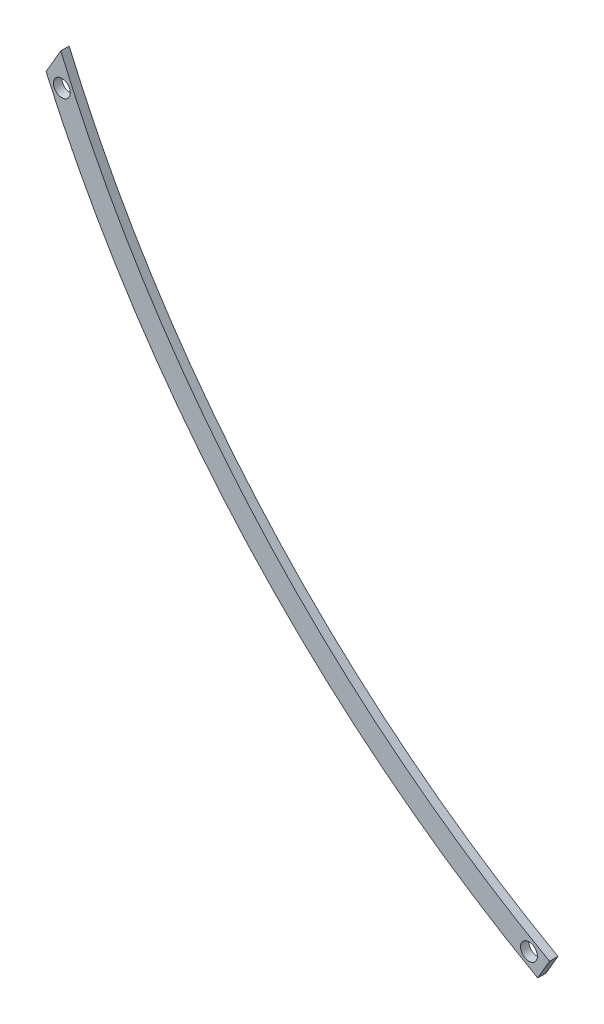
ISO-10303-21;
HEADER;
FILE_DESCRIPTION(('STEP AP214'),'2;1');
FILE_NAME('part.step','',(''),(''),'','','');
FILE_SCHEMA(('AUTOMOTIVE_DESIGN { 1 0 10303 214 1 1 1 1 }'));
ENDSEC;
DATA;
#1=APPLICATION_CONTEXT('core data for automotive mechanical design processes');
#2=APPLICATION_PROTOCOL_DEFINITION('international standard','automotive_design',2000,#1);
#3=PRODUCT_CONTEXT('',#1,'mechanical');
#4=PRODUCT('Part','Part','',(#3));
#5=PRODUCT_RELATED_PRODUCT_CATEGORY('part','',(#4));
#6=PRODUCT_DEFINITION_FORMATION('','',#4);
#7=PRODUCT_DEFINITION_CONTEXT('part definition',#1,'design');
#8=PRODUCT_DEFINITION('design','',#6,#7);
#9=PRODUCT_DEFINITION_SHAPE('','',#8);
#10=(LENGTH_UNIT() NAMED_UNIT(*) SI_UNIT(.MILLI.,.METRE.));
#11=(NAMED_UNIT(*) PLANE_ANGLE_UNIT() SI_UNIT($,.RADIAN.));
#12=(NAMED_UNIT(*) SI_UNIT($,.STERADIAN.) SOLID_ANGLE_UNIT());
#13=UNCERTAINTY_MEASURE_WITH_UNIT(LENGTH_MEASURE(1.E-05),#10,'distance_accuracy_value','');
#14=(GEOMETRIC_REPRESENTATION_CONTEXT(3) GLOBAL_UNCERTAINTY_ASSIGNED_CONTEXT((#13)) GLOBAL_UNIT_ASSIGNED_CONTEXT((#10,
#11,#12)) REPRESENTATION_CONTEXT('',''));
#15=CARTESIAN_POINT('',(0.,0.,0.));
#16=DIRECTION('',(0.,0.,1.));
#17=DIRECTION('',(1.,0.,0.));
#18=AXIS2_PLACEMENT_3D('',#15,#16,#17);
#19=CARTESIAN_POINT('',(3412.34924773845,5885.24743515971,50.));
#20=DIRECTION('',(0.,0.,-1.));
#21=DIRECTION('',(-1.,0.,0.));
#22=AXIS2_PLACEMENT_3D('',#19,#20,#21);
#23=PLANE('',#22);
#24=CARTESIAN_POINT('',(3412.34924773845,5885.24743515971,50.));
#25=DIRECTION('',(0.,0.,-1.));
#26=DIRECTION('',(-1.,0.,0.));
#27=AXIS2_PLACEMENT_3D('',#24,#25,#26);
#28=CIRCLE('',#27,6732.95999999964);
#29=CARTESIAN_POINT('',(121.994454448105,11.0397697918607,50.));
#30=VERTEX_POINT('',#29);
#31=CARTESIAN_POINT('',(-2779.46844110716,3240.60302244677,50.));
#32=VERTEX_POINT('',#31);
#33=EDGE_CURVE('E50',#30,#32,#28,.T.);
#34=ORIENTED_EDGE('',*,*,#33,.T.);
#35=DIRECTION('',(-0.501597723305544,-0.865100990621728,0.));
#36=VECTOR('',#35,1.);
#37=CARTESIAN_POINT('',(-2779.46844110716,3240.60302244677,50.));
#38=LINE('',#37,#36);
#39=CARTESIAN_POINT('',(-2866.63608223872,3090.26579165529,50.));
#40=VERTEX_POINT('',#39);
#41=EDGE_CURVE('E79',#32,#40,#38,.T.);
#42=ORIENTED_EDGE('',*,*,#41,.T.);
#43=CARTESIAN_POINT('',(3412.34924773845,5885.24743515971,50.));
#44=DIRECTION('',(0.,0.,1.));
#45=DIRECTION('',(-1.,0.,0.));
#46=AXIS2_PLACEMENT_3D('',#43,#44,#45);
#47=CIRCLE('',#46,6872.95999999965);
#48=CARTESIAN_POINT('',(51.7631843671055,-110.087457260338,50.));
#49=VERTEX_POINT('',#48);
#50=EDGE_CURVE('E83',#40,#49,#47,.T.);
#51=ORIENTED_EDGE('',*,*,#50,.T.);
#52=DIRECTION('',(0.501597723305545,0.865100990621728,0.));
#53=VECTOR('',#52,1.);
#54=CARTESIAN_POINT('',(51.7631843671055,-110.087457260338,50.));
#55=LINE('',#54,#53);
#56=EDGE_CURVE('E92',#49,#30,#55,.T.);
#57=ORIENTED_EDGE('',*,*,#56,.T.);
#58=EDGE_LOOP('',(#34,#42,#51,#57));
#59=FACE_BOUND('',#58,.T.);
#60=CARTESIAN_POINT('',(-2772.84973901146,3052.65529086794,50.));
#61=DIRECTION('',(0.,0.,1.));
#62=DIRECTION('',(1.,0.,0.));
#63=AXIS2_PLACEMENT_3D('',#60,#61,#62);
#64=CIRCLE('',#63,50.);
#65=CARTESIAN_POINT('',(-2722.84973901146,3052.65529086794,50.));
#66=VERTEX_POINT('',#65);
#67=EDGE_CURVE('E99',#66,#66,#64,.T.);
#68=ORIENTED_EDGE('',*,*,#67,.F.);
#69=EDGE_LOOP('',(#68));
#70=FACE_BOUND('',#69,.T.);
#71=CARTESIAN_POINT('',(0.,0.,50.));
#72=DIRECTION('',(0.,0.,1.));
#73=DIRECTION('',(1.,0.,0.));
#74=AXIS2_PLACEMENT_3D('',#71,#72,#73);
#75=CIRCLE('',#74,50.0000000000012);
#76=CARTESIAN_POINT('',(50.0000000000012,0.,50.));
#77=VERTEX_POINT('',#76);
#78=EDGE_CURVE('E137',#77,#77,#75,.T.);
#79=ORIENTED_EDGE('',*,*,#78,.F.);
#80=EDGE_LOOP('',(#79));
#81=FACE_BOUND('',#80,.T.);
#82=ADVANCED_FACE('F33',(#59,#70,#81),#23,.F.);
#83=CARTESIAN_POINT('',(3412.34924773845,5885.24743515971,0.));
#84=DIRECTION('',(0.,0.,-1.));
#85=DIRECTION('',(-1.,0.,0.));
#86=AXIS2_PLACEMENT_3D('',#83,#84,#85);
#87=PLANE('',#86);
#88=CARTESIAN_POINT('',(-2772.84973901146,3052.65529086794,0.));
#89=DIRECTION('',(0.,0.,1.));
#90=DIRECTION('',(1.,0.,0.));
#91=AXIS2_PLACEMENT_3D('',#88,#89,#90);
#92=CIRCLE('',#91,50.);
#93=CARTESIAN_POINT('',(-2722.84973901146,3052.65529086794,0.));
#94=VERTEX_POINT('',#93);
#95=EDGE_CURVE('E142',#94,#94,#92,.T.);
#96=ORIENTED_EDGE('',*,*,#95,.T.);
#97=EDGE_LOOP('',(#96));
#98=FACE_BOUND('',#97,.T.);
#99=DIRECTION('',(-0.501597723305544,-0.865100990621728,0.));
#100=VECTOR('',#99,1.);
#101=CARTESIAN_POINT('',(-2779.46844110716,3240.60302244677,0.));
#102=LINE('',#101,#100);
#103=CARTESIAN_POINT('',(-2779.46844110716,3240.60302244677,0.));
#104=VERTEX_POINT('',#103);
#105=CARTESIAN_POINT('',(-2866.63608223872,3090.26579165529,0.));
#106=VERTEX_POINT('',#105);
#107=EDGE_CURVE('E88',#104,#106,#102,.T.);
#108=ORIENTED_EDGE('',*,*,#107,.F.);
#109=CARTESIAN_POINT('',(3412.34924773851,5885.24743515972,0.));
#110=DIRECTION('',(0.,0.,-1.));
#111=DIRECTION('',(1.,0.,0.));
#112=AXIS2_PLACEMENT_3D('',#109,#110,#111);
#113=CIRCLE('',#112,6732.95999999968);
#114=CARTESIAN_POINT('',(121.994454448105,11.0397697918607,0.));
#115=VERTEX_POINT('',#114);
#116=EDGE_CURVE('E102',#115,#104,#113,.T.);
#117=ORIENTED_EDGE('',*,*,#116,.F.);
#118=DIRECTION('',(0.501597723305545,0.865100990621728,0.));
#119=VECTOR('',#118,1.);
#120=CARTESIAN_POINT('',(51.7631843671055,-110.087457260338,0.));
#121=LINE('',#120,#119);
#122=CARTESIAN_POINT('',(51.7631843671055,-110.087457260338,0.));
#123=VERTEX_POINT('',#122);
#124=EDGE_CURVE('E74',#123,#115,#121,.T.);
#125=ORIENTED_EDGE('',*,*,#124,.F.);
#126=CARTESIAN_POINT('',(3412.34924773851,5885.24743515972,0.));
#127=DIRECTION('',(0.,0.,1.));
#128=DIRECTION('',(1.,0.,0.));
#129=AXIS2_PLACEMENT_3D('',#126,#127,#128);
#130=CIRCLE('',#129,6872.95999999966);
#131=EDGE_CURVE('E67',#106,#123,#130,.T.);
#132=ORIENTED_EDGE('',*,*,#131,.F.);
#133=EDGE_LOOP('',(#108,#117,#125,#132));
#134=FACE_BOUND('',#133,.T.);
#135=CARTESIAN_POINT('',(0.,0.,0.));
#136=DIRECTION('',(0.,0.,1.));
#137=DIRECTION('',(1.,0.,0.));
#138=AXIS2_PLACEMENT_3D('',#135,#136,#137);
#139=CIRCLE('',#138,50.0000000000012);
#140=CARTESIAN_POINT('',(50.0000000000012,0.,0.));
#141=VERTEX_POINT('',#140);
#142=EDGE_CURVE('E140',#141,#141,#139,.T.);
#143=ORIENTED_EDGE('',*,*,#142,.T.);
#144=EDGE_LOOP('',(#143));
#145=FACE_BOUND('',#144,.T.);
#146=ADVANCED_FACE('F108',(#98,#134,#145),#87,.T.);
#147=CARTESIAN_POINT('',(-2779.46844110716,3240.60302244677,50.));
#148=DIRECTION('',(0.865100990621728,-0.501597723305544,0.));
#149=DIRECTION('',(0.501597723305544,0.865100990621728,0.));
#150=AXIS2_PLACEMENT_3D('',#147,#148,#149);
#151=PLANE('',#150);
#152=ORIENTED_EDGE('',*,*,#107,.T.);
#153=DIRECTION('',(0.,0.,-1.));
#154=VECTOR('',#153,1.);
#155=CARTESIAN_POINT('',(-2866.63608223872,3090.26579165529,50.));
#156=LINE('',#155,#154);
#157=EDGE_CURVE('E42',#40,#106,#156,.T.);
#158=ORIENTED_EDGE('',*,*,#157,.F.);
#159=ORIENTED_EDGE('',*,*,#41,.F.);
#160=DIRECTION('',(0.,0.,-1.));
#161=VECTOR('',#160,1.);
#162=CARTESIAN_POINT('',(-2779.46844110716,3240.60302244677,50.));
#163=LINE('',#162,#161);
#164=EDGE_CURVE('E11',#32,#104,#163,.T.);
#165=ORIENTED_EDGE('',*,*,#164,.T.);
#166=EDGE_LOOP('',(#152,#158,#159,#165));
#167=FACE_BOUND('',#166,.T.);
#168=ADVANCED_FACE('F35',(#167),#151,.F.);
#169=CARTESIAN_POINT('',(3412.34924773851,5885.24743515972,50.));
#170=DIRECTION('',(0.,0.,-1.));
#171=DIRECTION('',(-1.,0.,0.));
#172=AXIS2_PLACEMENT_3D('',#169,#170,#171);
#173=CYLINDRICAL_SURFACE('',#172,6872.95999999966);
#174=ORIENTED_EDGE('',*,*,#131,.T.);
#175=DIRECTION('',(0.,0.,-1.));
#176=VECTOR('',#175,1.);
#177=CARTESIAN_POINT('',(51.7631843671055,-110.087457260338,50.));
#178=LINE('',#177,#176);
#179=EDGE_CURVE('E89',#49,#123,#178,.T.);
#180=ORIENTED_EDGE('',*,*,#179,.F.);
#181=ORIENTED_EDGE('',*,*,#50,.F.);
#182=ORIENTED_EDGE('',*,*,#157,.T.);
#183=EDGE_LOOP('',(#174,#180,#181,#182));
#184=FACE_BOUND('',#183,.T.);
#185=ADVANCED_FACE('F90',(#184),#173,.T.);
#186=CARTESIAN_POINT('',(51.7631843671055,-110.087457260338,50.));
#187=DIRECTION('',(-0.865100990621728,0.501597723305545,0.));
#188=DIRECTION('',(-0.501597723305545,-0.865100990621728,0.));
#189=AXIS2_PLACEMENT_3D('',#186,#187,#188);
#190=PLANE('',#189);
#191=ORIENTED_EDGE('',*,*,#124,.T.);
#192=DIRECTION('',(0.,0.,-1.));
#193=VECTOR('',#192,1.);
#194=CARTESIAN_POINT('',(121.994454448105,11.0397697918607,50.));
#195=LINE('',#194,#193);
#196=EDGE_CURVE('E94',#30,#115,#195,.T.);
#197=ORIENTED_EDGE('',*,*,#196,.F.);
#198=ORIENTED_EDGE('',*,*,#56,.F.);
#199=ORIENTED_EDGE('',*,*,#179,.T.);
#200=EDGE_LOOP('',(#191,#197,#198,#199));
#201=FACE_BOUND('',#200,.T.);
#202=ADVANCED_FACE('F105',(#201),#190,.F.);
#203=CARTESIAN_POINT('',(3412.34924773851,5885.24743515972,50.));
#204=DIRECTION('',(0.,0.,-1.));
#205=DIRECTION('',(-1.,0.,0.));
#206=AXIS2_PLACEMENT_3D('',#203,#204,#205);
#207=CYLINDRICAL_SURFACE('',#206,6732.95999999968);
#208=ORIENTED_EDGE('',*,*,#116,.T.);
#209=ORIENTED_EDGE('',*,*,#164,.F.);
#210=ORIENTED_EDGE('',*,*,#33,.F.);
#211=ORIENTED_EDGE('',*,*,#196,.T.);
#212=EDGE_LOOP('',(#208,#209,#210,#211));
#213=FACE_BOUND('',#212,.T.);
#214=ADVANCED_FACE('F110',(#213),#207,.F.);
#215=CARTESIAN_POINT('',(-2772.84973901146,3052.65529086794,50.));
#216=DIRECTION('',(0.,0.,-1.));
#217=DIRECTION('',(-1.,0.,0.));
#218=AXIS2_PLACEMENT_3D('',#215,#216,#217);
#219=CYLINDRICAL_SURFACE('',#218,50.);
#220=ORIENTED_EDGE('',*,*,#67,.T.);
#221=EDGE_LOOP('',(#220));
#222=FACE_BOUND('',#221,.T.);
#223=ORIENTED_EDGE('',*,*,#95,.F.);
#224=EDGE_LOOP('',(#223));
#225=FACE_BOUND('',#224,.T.);
#226=ADVANCED_FACE('F112',(#222,#225),#219,.F.);
#227=CARTESIAN_POINT('',(0.,0.,50.));
#228=DIRECTION('',(0.,0.,-1.));
#229=DIRECTION('',(-1.,0.,0.));
#230=AXIS2_PLACEMENT_3D('',#227,#228,#229);
#231=CYLINDRICAL_SURFACE('',#230,50.0000000000012);
#232=ORIENTED_EDGE('',*,*,#78,.T.);
#233=EDGE_LOOP('',(#232));
#234=FACE_BOUND('',#233,.T.);
#235=ORIENTED_EDGE('',*,*,#142,.F.);
#236=EDGE_LOOP('',(#235));
#237=FACE_BOUND('',#236,.T.);
#238=ADVANCED_FACE('F118',(#234,#237),#231,.F.);
#239=CLOSED_SHELL('',(#82,#146,#168,#185,#202,#214,#226,#238));
#240=MANIFOLD_SOLID_BREP('B2',#239);
#241=ADVANCED_BREP_SHAPE_REPRESENTATION('',(#18,#240),#14);
#242=SHAPE_DEFINITION_REPRESENTATION(#9,#241);
ENDSEC;
END-ISO-10303-21;
